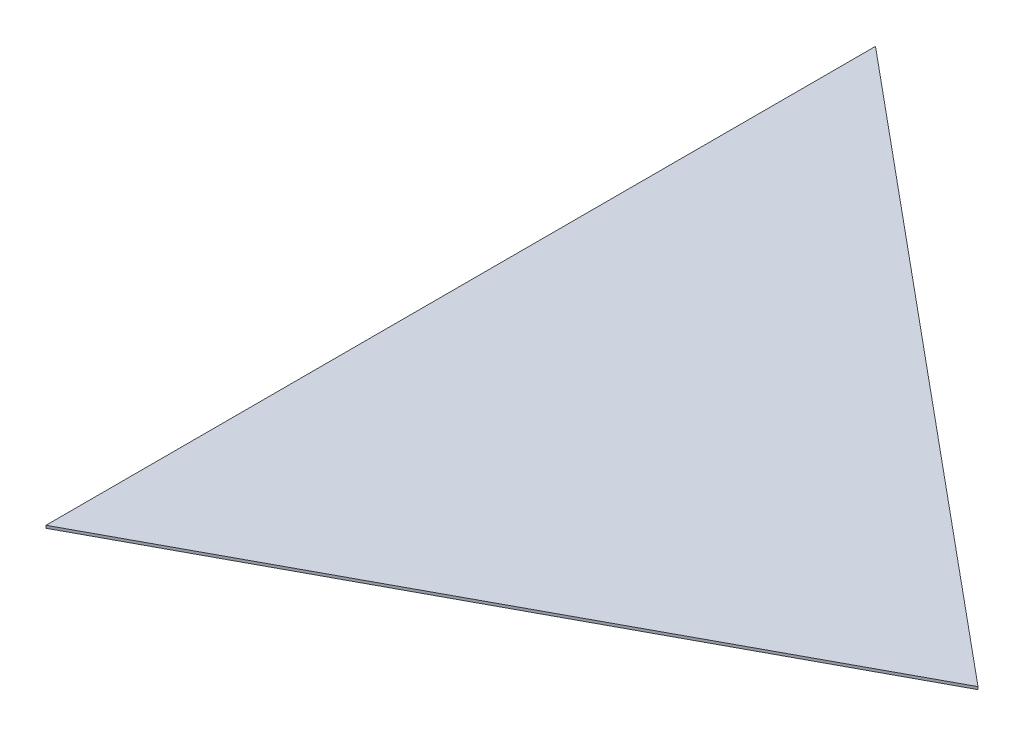
ISO-10303-21;
HEADER;
FILE_DESCRIPTION(('STEP AP214'),'2;1');
FILE_NAME('part.step','',(''),(''),'','','');
FILE_SCHEMA(('AUTOMOTIVE_DESIGN { 1 0 10303 214 1 1 1 1 }'));
ENDSEC;
DATA;
#1=APPLICATION_CONTEXT('core data for automotive mechanical design processes');
#2=APPLICATION_PROTOCOL_DEFINITION('international standard','automotive_design',2000,#1);
#3=PRODUCT_CONTEXT('',#1,'mechanical');
#4=PRODUCT('Part','Part','',(#3));
#5=PRODUCT_RELATED_PRODUCT_CATEGORY('part','',(#4));
#6=PRODUCT_DEFINITION_FORMATION('','',#4);
#7=PRODUCT_DEFINITION_CONTEXT('part definition',#1,'design');
#8=PRODUCT_DEFINITION('design','',#6,#7);
#9=PRODUCT_DEFINITION_SHAPE('','',#8);
#10=(LENGTH_UNIT() NAMED_UNIT(*) SI_UNIT(.MILLI.,.METRE.));
#11=(NAMED_UNIT(*) PLANE_ANGLE_UNIT() SI_UNIT($,.RADIAN.));
#12=(NAMED_UNIT(*) SI_UNIT($,.STERADIAN.) SOLID_ANGLE_UNIT());
#13=UNCERTAINTY_MEASURE_WITH_UNIT(LENGTH_MEASURE(1.E-05),#10,'distance_accuracy_value','');
#14=(GEOMETRIC_REPRESENTATION_CONTEXT(3) GLOBAL_UNCERTAINTY_ASSIGNED_CONTEXT((#13)) GLOBAL_UNIT_ASSIGNED_CONTEXT((#10,
#11,#12)) REPRESENTATION_CONTEXT('',''));
#15=CARTESIAN_POINT('',(0.,0.,0.));
#16=DIRECTION('',(0.,0.,1.));
#17=DIRECTION('',(1.,0.,0.));
#18=AXIS2_PLACEMENT_3D('',#15,#16,#17);
#19=CARTESIAN_POINT('',(366.522,1.5875,-197.408210978214));
#20=DIRECTION('',(-0.474193321977149,0.,-0.88042074793378));
#21=DIRECTION('',(-0.88042074793378,0.,0.474193321977149));
#22=AXIS2_PLACEMENT_3D('',#19,#20,#21);
#23=PLANE('',#22);
#24=DIRECTION('',(0.88042074793378,0.,-0.474193321977149));
#25=VECTOR('',#24,1.);
#26=CARTESIAN_POINT('',(366.522,0.,-197.408210978214));
#27=LINE('',#26,#25);
#28=CARTESIAN_POINT('',(0.,0.,0.));
#29=VERTEX_POINT('',#28);
#30=CARTESIAN_POINT('',(366.522,0.,-197.408210978214));
#31=VERTEX_POINT('',#30);
#32=EDGE_CURVE('E80',#29,#31,#27,.T.);
#33=ORIENTED_EDGE('',*,*,#32,.T.);
#34=DIRECTION('',(0.,-1.,0.));
#35=VECTOR('',#34,1.);
#36=CARTESIAN_POINT('',(366.522,1.5875,-197.408210978214));
#37=LINE('',#36,#35);
#38=CARTESIAN_POINT('',(366.522,1.5875,-197.408210978214));
#39=VERTEX_POINT('',#38);
#40=EDGE_CURVE('E11',#39,#31,#37,.T.);
#41=ORIENTED_EDGE('',*,*,#40,.F.);
#42=DIRECTION('',(0.88042074793378,0.,-0.474193321977149));
#43=VECTOR('',#42,1.);
#44=CARTESIAN_POINT('',(366.522,1.5875,-197.408210978214));
#45=LINE('',#44,#43);
#46=CARTESIAN_POINT('',(0.,1.5875,0.));
#47=VERTEX_POINT('',#46);
#48=EDGE_CURVE('E73',#47,#39,#45,.T.);
#49=ORIENTED_EDGE('',*,*,#48,.F.);
#50=DIRECTION('',(0.,-1.,0.));
#51=VECTOR('',#50,1.);
#52=CARTESIAN_POINT('',(0.,1.5875,0.));
#53=LINE('',#52,#51);
#54=EDGE_CURVE('E81',#47,#29,#53,.T.);
#55=ORIENTED_EDGE('',*,*,#54,.T.);
#56=EDGE_LOOP('',(#33,#41,#49,#55));
#57=FACE_BOUND('',#56,.T.);
#58=ADVANCED_FACE('F33',(#57),#23,.F.);
#59=CARTESIAN_POINT('',(0.,1.5875,-501.904));
#60=DIRECTION('',(-0.63902042589734,0.,0.769189765458422));
#61=DIRECTION('',(0.769189765458422,0.,0.63902042589734));
#62=AXIS2_PLACEMENT_3D('',#59,#60,#61);
#63=PLANE('',#62);
#64=DIRECTION('',(-0.769189765458422,0.,-0.63902042589734));
#65=VECTOR('',#64,1.);
#66=CARTESIAN_POINT('',(0.,0.,-501.904));
#67=LINE('',#66,#65);
#68=CARTESIAN_POINT('',(0.,0.,-501.904));
#69=VERTEX_POINT('',#68);
#70=EDGE_CURVE('E61',#31,#69,#67,.T.);
#71=ORIENTED_EDGE('',*,*,#70,.T.);
#72=DIRECTION('',(0.,-1.,0.));
#73=VECTOR('',#72,1.);
#74=CARTESIAN_POINT('',(0.,1.5875,-501.904));
#75=LINE('',#74,#73);
#76=CARTESIAN_POINT('',(0.,1.5875,-501.904));
#77=VERTEX_POINT('',#76);
#78=EDGE_CURVE('E41',#77,#69,#75,.T.);
#79=ORIENTED_EDGE('',*,*,#78,.F.);
#80=DIRECTION('',(-0.769189765458422,0.,-0.63902042589734));
#81=VECTOR('',#80,1.);
#82=CARTESIAN_POINT('',(0.,1.5875,-501.904));
#83=LINE('',#82,#81);
#84=EDGE_CURVE('E69',#39,#77,#83,.T.);
#85=ORIENTED_EDGE('',*,*,#84,.F.);
#86=ORIENTED_EDGE('',*,*,#40,.T.);
#87=EDGE_LOOP('',(#71,#79,#85,#86));
#88=FACE_BOUND('',#87,.T.);
#89=ADVANCED_FACE('F70',(#88),#63,.F.);
#90=CARTESIAN_POINT('',(0.,1.5875,0.));
#91=DIRECTION('',(1.,0.,0.));
#92=DIRECTION('',(0.,0.,-1.));
#93=AXIS2_PLACEMENT_3D('',#90,#91,#92);
#94=PLANE('',#93);
#95=DIRECTION('',(0.,0.,1.));
#96=VECTOR('',#95,1.);
#97=CARTESIAN_POINT('',(0.,0.,0.));
#98=LINE('',#97,#96);
#99=EDGE_CURVE('E66',#69,#29,#98,.T.);
#100=ORIENTED_EDGE('',*,*,#99,.T.);
#101=ORIENTED_EDGE('',*,*,#54,.F.);
#102=DIRECTION('',(0.,0.,1.));
#103=VECTOR('',#102,1.);
#104=CARTESIAN_POINT('',(0.,1.5875,0.));
#105=LINE('',#104,#103);
#106=EDGE_CURVE('E49',#77,#47,#105,.T.);
#107=ORIENTED_EDGE('',*,*,#106,.F.);
#108=ORIENTED_EDGE('',*,*,#78,.T.);
#109=EDGE_LOOP('',(#100,#101,#107,#108));
#110=FACE_BOUND('',#109,.T.);
#111=ADVANCED_FACE('F88',(#110),#94,.F.);
#112=CARTESIAN_POINT('',(0.,1.5875,0.));
#113=DIRECTION('',(0.,1.,0.));
#114=DIRECTION('',(0.,0.,1.));
#115=AXIS2_PLACEMENT_3D('',#112,#113,#114);
#116=PLANE('',#115);
#117=ORIENTED_EDGE('',*,*,#48,.T.);
#118=ORIENTED_EDGE('',*,*,#84,.T.);
#119=ORIENTED_EDGE('',*,*,#106,.T.);
#120=EDGE_LOOP('',(#117,#118,#119));
#121=FACE_BOUND('',#120,.T.);
#122=ADVANCED_FACE('F76',(#121),#116,.T.);
#123=CARTESIAN_POINT('',(0.,0.,0.));
#124=DIRECTION('',(0.,1.,0.));
#125=DIRECTION('',(0.,0.,1.));
#126=AXIS2_PLACEMENT_3D('',#123,#124,#125);
#127=PLANE('',#126);
#128=ORIENTED_EDGE('',*,*,#32,.F.);
#129=ORIENTED_EDGE('',*,*,#99,.F.);
#130=ORIENTED_EDGE('',*,*,#70,.F.);
#131=EDGE_LOOP('',(#128,#129,#130));
#132=FACE_BOUND('',#131,.T.);
#133=ADVANCED_FACE('F89',(#132),#127,.F.);
#134=CLOSED_SHELL('',(#58,#89,#111,#122,#133));
#135=MANIFOLD_SOLID_BREP('B2',#134);
#136=ADVANCED_BREP_SHAPE_REPRESENTATION('',(#18,#135),#14);
#137=SHAPE_DEFINITION_REPRESENTATION(#9,#136);
ENDSEC;
END-ISO-10303-21;
